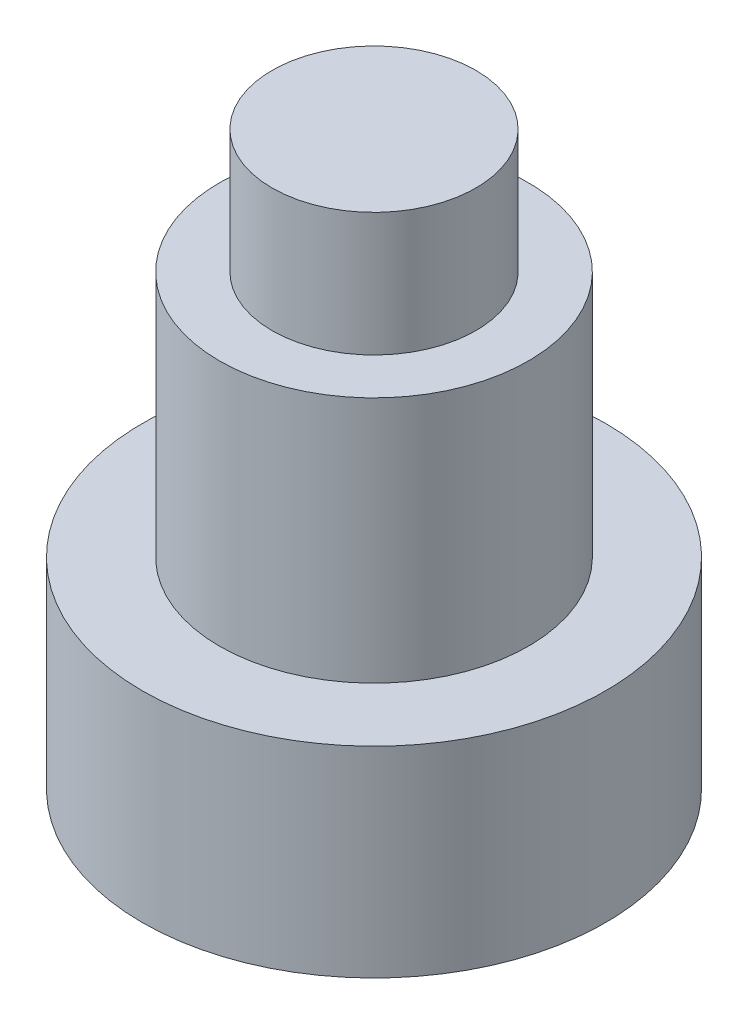
ISO-10303-21;
HEADER;
FILE_DESCRIPTION(('STEP AP214'),'2;1');
FILE_NAME('part.step','',(''),(''),'','','');
FILE_SCHEMA(('AUTOMOTIVE_DESIGN { 1 0 10303 214 1 1 1 1 }'));
ENDSEC;
DATA;
#1=APPLICATION_CONTEXT('core data for automotive mechanical design processes');
#2=APPLICATION_PROTOCOL_DEFINITION('international standard','automotive_design',2000,#1);
#3=PRODUCT_CONTEXT('',#1,'mechanical');
#4=PRODUCT('Part','Part','',(#3));
#5=PRODUCT_RELATED_PRODUCT_CATEGORY('part','',(#4));
#6=PRODUCT_DEFINITION_FORMATION('','',#4);
#7=PRODUCT_DEFINITION_CONTEXT('part definition',#1,'design');
#8=PRODUCT_DEFINITION('design','',#6,#7);
#9=PRODUCT_DEFINITION_SHAPE('','',#8);
#10=(LENGTH_UNIT() NAMED_UNIT(*) SI_UNIT(.MILLI.,.METRE.));
#11=(NAMED_UNIT(*) PLANE_ANGLE_UNIT() SI_UNIT($,.RADIAN.));
#12=(NAMED_UNIT(*) SI_UNIT($,.STERADIAN.) SOLID_ANGLE_UNIT());
#13=UNCERTAINTY_MEASURE_WITH_UNIT(LENGTH_MEASURE(1.E-05),#10,'distance_accuracy_value','');
#14=(GEOMETRIC_REPRESENTATION_CONTEXT(3) GLOBAL_UNCERTAINTY_ASSIGNED_CONTEXT((#13)) GLOBAL_UNIT_ASSIGNED_CONTEXT((#10,
#11,#12)) REPRESENTATION_CONTEXT('',''));
#15=CARTESIAN_POINT('',(0.,0.,0.));
#16=DIRECTION('',(0.,0.,1.));
#17=DIRECTION('',(1.,0.,0.));
#18=AXIS2_PLACEMENT_3D('',#15,#16,#17);
#19=CARTESIAN_POINT('',(0.,7.25,0.));
#20=DIRECTION('',(0.,-1.,0.));
#21=DIRECTION('',(0.,0.,-1.));
#22=AXIS2_PLACEMENT_3D('',#19,#20,#21);
#23=CYLINDRICAL_SURFACE('',#22,3.75);
#24=CARTESIAN_POINT('',(0.,0.,0.));
#25=DIRECTION('',(0.,1.,0.));
#26=DIRECTION('',(0.,0.,1.));
#27=AXIS2_PLACEMENT_3D('',#24,#25,#26);
#28=CIRCLE('',#27,3.75);
#29=CARTESIAN_POINT('',(0.,0.,3.75));
#30=VERTEX_POINT('',#29);
#31=EDGE_CURVE('E40',#30,#30,#28,.T.);
#32=ORIENTED_EDGE('',*,*,#31,.T.);
#33=EDGE_LOOP('',(#32));
#34=FACE_BOUND('',#33,.T.);
#35=CARTESIAN_POINT('',(0.,3.25,0.));
#36=DIRECTION('',(0.,1.,0.));
#37=DIRECTION('',(0.,0.,1.));
#38=AXIS2_PLACEMENT_3D('',#35,#36,#37);
#39=CIRCLE('',#38,3.75);
#40=CARTESIAN_POINT('',(0.,3.25,3.75));
#41=VERTEX_POINT('',#40);
#42=EDGE_CURVE('E50',#41,#41,#39,.T.);
#43=ORIENTED_EDGE('',*,*,#42,.F.);
#44=EDGE_LOOP('',(#43));
#45=FACE_BOUND('',#44,.T.);
#46=ADVANCED_FACE('F37',(#34,#45),#23,.T.);
#47=CARTESIAN_POINT('',(0.,0.,0.));
#48=DIRECTION('',(0.,1.,0.));
#49=DIRECTION('',(0.,0.,1.));
#50=AXIS2_PLACEMENT_3D('',#47,#48,#49);
#51=PLANE('',#50);
#52=ORIENTED_EDGE('',*,*,#31,.F.);
#53=EDGE_LOOP('',(#52));
#54=FACE_BOUND('',#53,.T.);
#55=ADVANCED_FACE('F68',(#54),#51,.F.);
#56=CARTESIAN_POINT('',(0.,3.25,0.));
#57=DIRECTION('',(0.,1.,0.));
#58=DIRECTION('',(0.,0.,1.));
#59=AXIS2_PLACEMENT_3D('',#56,#57,#58);
#60=PLANE('',#59);
#61=CARTESIAN_POINT('',(0.,3.25,0.));
#62=DIRECTION('',(0.,1.,0.));
#63=DIRECTION('',(0.,0.,1.));
#64=AXIS2_PLACEMENT_3D('',#61,#62,#63);
#65=CIRCLE('',#64,2.5);
#66=CARTESIAN_POINT('',(0.,3.25,2.5));
#67=VERTEX_POINT('',#66);
#68=EDGE_CURVE('E54',#67,#67,#65,.T.);
#69=ORIENTED_EDGE('',*,*,#68,.F.);
#70=EDGE_LOOP('',(#69));
#71=FACE_BOUND('',#70,.T.);
#72=ORIENTED_EDGE('',*,*,#42,.T.);
#73=EDGE_LOOP('',(#72));
#74=FACE_BOUND('',#73,.T.);
#75=ADVANCED_FACE('F65',(#71,#74),#60,.T.);
#76=CARTESIAN_POINT('',(0.,3.25,0.));
#77=DIRECTION('',(0.,1.,0.));
#78=DIRECTION('',(0.,0.,1.));
#79=AXIS2_PLACEMENT_3D('',#76,#77,#78);
#80=CYLINDRICAL_SURFACE('',#79,2.5);
#81=ORIENTED_EDGE('',*,*,#68,.T.);
#82=EDGE_LOOP('',(#81));
#83=FACE_BOUND('',#82,.T.);
#84=CARTESIAN_POINT('',(0.,7.25,0.));
#85=DIRECTION('',(0.,1.,0.));
#86=DIRECTION('',(0.,0.,1.));
#87=AXIS2_PLACEMENT_3D('',#84,#85,#86);
#88=CIRCLE('',#87,2.5);
#89=CARTESIAN_POINT('',(0.,7.25,2.5));
#90=VERTEX_POINT('',#89);
#91=EDGE_CURVE('E58',#90,#90,#88,.T.);
#92=ORIENTED_EDGE('',*,*,#91,.F.);
#93=EDGE_LOOP('',(#92));
#94=FACE_BOUND('',#93,.T.);
#95=ADVANCED_FACE('F80',(#83,#94),#80,.T.);
#96=CARTESIAN_POINT('',(0.,7.25,0.));
#97=DIRECTION('',(0.,1.,0.));
#98=DIRECTION('',(0.,0.,1.));
#99=AXIS2_PLACEMENT_3D('',#96,#97,#98);
#100=PLANE('',#99);
#101=CARTESIAN_POINT('',(0.,7.25,0.));
#102=DIRECTION('',(0.,1.,0.));
#103=DIRECTION('',(0.,0.,1.));
#104=AXIS2_PLACEMENT_3D('',#101,#102,#103);
#105=CIRCLE('',#104,1.65);
#106=CARTESIAN_POINT('',(0.,7.25,1.65));
#107=VERTEX_POINT('',#106);
#108=EDGE_CURVE('E10',#107,#107,#105,.T.);
#109=ORIENTED_EDGE('',*,*,#108,.F.);
#110=EDGE_LOOP('',(#109));
#111=FACE_BOUND('',#110,.T.);
#112=ORIENTED_EDGE('',*,*,#91,.T.);
#113=EDGE_LOOP('',(#112));
#114=FACE_BOUND('',#113,.T.);
#115=ADVANCED_FACE('F84',(#111,#114),#100,.T.);
#116=CARTESIAN_POINT('',(0.,9.25,0.));
#117=DIRECTION('',(0.,-1.,0.));
#118=DIRECTION('',(0.,0.,-1.));
#119=AXIS2_PLACEMENT_3D('',#116,#117,#118);
#120=CYLINDRICAL_SURFACE('',#119,1.65);
#121=CARTESIAN_POINT('',(0.,9.25,0.));
#122=DIRECTION('',(0.,1.,0.));
#123=DIRECTION('',(0.,0.,1.));
#124=AXIS2_PLACEMENT_3D('',#121,#122,#123);
#125=CIRCLE('',#124,1.65);
#126=CARTESIAN_POINT('',(0.,9.25,1.65));
#127=VERTEX_POINT('',#126);
#128=EDGE_CURVE('E53',#127,#127,#125,.T.);
#129=ORIENTED_EDGE('',*,*,#128,.F.);
#130=EDGE_LOOP('',(#129));
#131=FACE_BOUND('',#130,.T.);
#132=ORIENTED_EDGE('',*,*,#108,.T.);
#133=EDGE_LOOP('',(#132));
#134=FACE_BOUND('',#133,.T.);
#135=ADVANCED_FACE('F86',(#131,#134),#120,.T.);
#136=CARTESIAN_POINT('',(0.,9.25,0.));
#137=DIRECTION('',(0.,1.,0.));
#138=DIRECTION('',(0.,0.,1.));
#139=AXIS2_PLACEMENT_3D('',#136,#137,#138);
#140=PLANE('',#139);
#141=ORIENTED_EDGE('',*,*,#128,.T.);
#142=EDGE_LOOP('',(#141));
#143=FACE_BOUND('',#142,.T.);
#144=ADVANCED_FACE('F94',(#143),#140,.T.);
#145=CLOSED_SHELL('',(#46,#55,#75,#95,#115,#135,#144));
#146=MANIFOLD_SOLID_BREP('B2',#145);
#147=ADVANCED_BREP_SHAPE_REPRESENTATION('',(#18,#146),#14);
#148=SHAPE_DEFINITION_REPRESENTATION(#9,#147);
ENDSEC;
END-ISO-10303-21;
